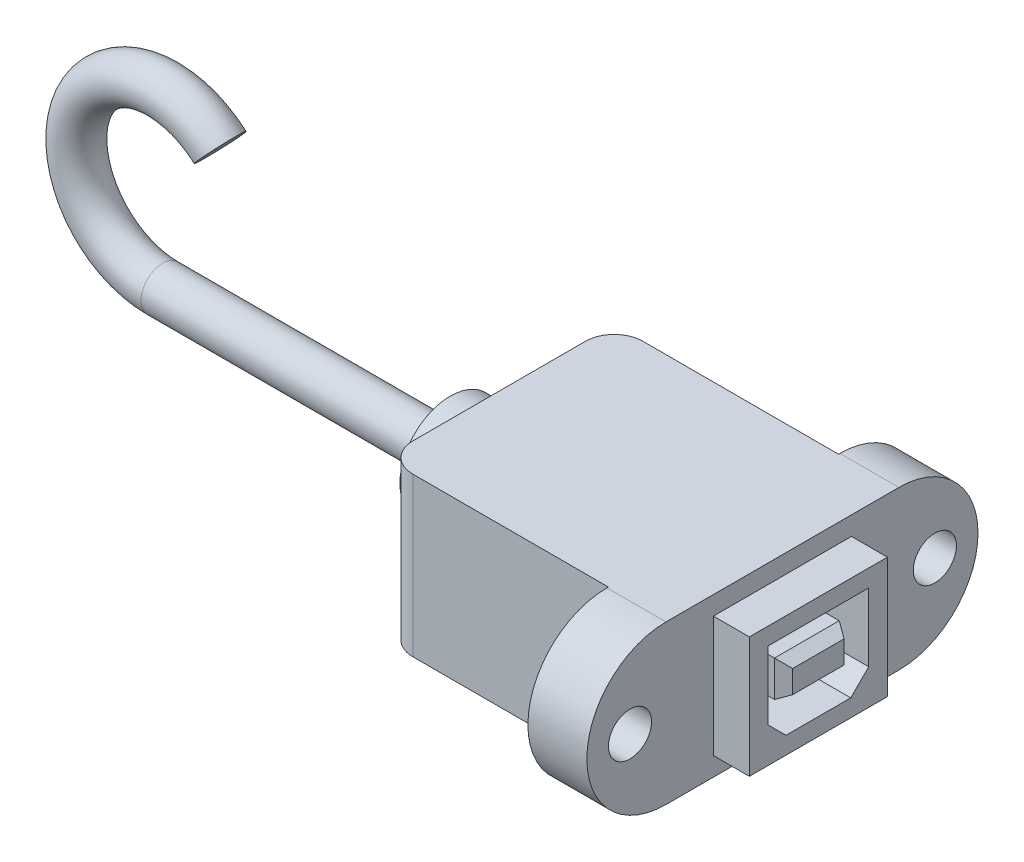
ISO-10303-21;
HEADER;
FILE_DESCRIPTION(('STEP AP214'),'2;1');
FILE_NAME('part.step','',(''),(''),'','','');
FILE_SCHEMA(('AUTOMOTIVE_DESIGN { 1 0 10303 214 1 1 1 1 }'));
ENDSEC;
DATA;
#1=APPLICATION_CONTEXT('core data for automotive mechanical design processes');
#2=APPLICATION_PROTOCOL_DEFINITION('international standard','automotive_design',2000,#1);
#3=PRODUCT_CONTEXT('',#1,'mechanical');
#4=PRODUCT('Part','Part','',(#3));
#5=PRODUCT_RELATED_PRODUCT_CATEGORY('part','',(#4));
#6=PRODUCT_DEFINITION_FORMATION('','',#4);
#7=PRODUCT_DEFINITION_CONTEXT('part definition',#1,'design');
#8=PRODUCT_DEFINITION('design','',#6,#7);
#9=PRODUCT_DEFINITION_SHAPE('','',#8);
#10=(LENGTH_UNIT() NAMED_UNIT(*) SI_UNIT(.MILLI.,.METRE.));
#11=(NAMED_UNIT(*) PLANE_ANGLE_UNIT() SI_UNIT($,.RADIAN.));
#12=(NAMED_UNIT(*) SI_UNIT($,.STERADIAN.) SOLID_ANGLE_UNIT());
#13=UNCERTAINTY_MEASURE_WITH_UNIT(LENGTH_MEASURE(1.E-05),#10,'distance_accuracy_value','');
#14=(GEOMETRIC_REPRESENTATION_CONTEXT(3) GLOBAL_UNCERTAINTY_ASSIGNED_CONTEXT((#13)) GLOBAL_UNIT_ASSIGNED_CONTEXT((#10,
#11,#12)) REPRESENTATION_CONTEXT('',''));
#15=CARTESIAN_POINT('',(0.,0.,0.));
#16=DIRECTION('',(0.,0.,1.));
#17=DIRECTION('',(1.,0.,0.));
#18=AXIS2_PLACEMENT_3D('',#15,#16,#17);
#19=CARTESIAN_POINT('',(25.019,13.97,-27.432));
#20=DIRECTION('',(-1.,0.,0.));
#21=DIRECTION('',(0.,0.,1.));
#22=AXIS2_PLACEMENT_3D('',#19,#20,#21);
#23=PLANE('',#22);
#24=CARTESIAN_POINT('',(25.019,6.985,-23.622));
#25=DIRECTION('',(1.,0.,0.));
#26=DIRECTION('',(0.,0.,-1.));
#27=AXIS2_PLACEMENT_3D('',#24,#25,#26);
#28=CIRCLE('',#27,1.905);
#29=CARTESIAN_POINT('',(25.019,6.985,-25.527));
#30=VERTEX_POINT('',#29);
#31=EDGE_CURVE('E315',#30,#30,#28,.T.);
#32=ORIENTED_EDGE('',*,*,#31,.F.);
#33=EDGE_LOOP('',(#32));
#34=FACE_BOUND('',#33,.T.);
#35=DIRECTION('',(0.,-1.,0.));
#36=VECTOR('',#35,1.);
#37=CARTESIAN_POINT('',(25.019,12.319,-4.064));
#38=LINE('',#37,#36);
#39=CARTESIAN_POINT('',(25.019,12.319,-4.064));
#40=VERTEX_POINT('',#39);
#41=CARTESIAN_POINT('',(25.019,1.651,-4.06400000000001));
#42=VERTEX_POINT('',#41);
#43=EDGE_CURVE('E388',#40,#42,#38,.T.);
#44=ORIENTED_EDGE('',*,*,#43,.F.);
#45=DIRECTION('',(0.,0.,1.));
#46=VECTOR('',#45,1.);
#47=CARTESIAN_POINT('',(25.019,12.319,-4.064));
#48=LINE('',#47,#46);
#49=CARTESIAN_POINT('',(25.019,12.319,-16.256));
#50=VERTEX_POINT('',#49);
#51=EDGE_CURVE('E403',#50,#40,#48,.T.);
#52=ORIENTED_EDGE('',*,*,#51,.F.);
#53=DIRECTION('',(0.,1.,0.));
#54=VECTOR('',#53,1.);
#55=CARTESIAN_POINT('',(25.019,12.319,-16.256));
#56=LINE('',#55,#54);
#57=CARTESIAN_POINT('',(25.019,1.651,-16.256));
#58=VERTEX_POINT('',#57);
#59=EDGE_CURVE('E415',#58,#50,#56,.T.);
#60=ORIENTED_EDGE('',*,*,#59,.F.);
#61=DIRECTION('',(0.,0.,-1.));
#62=VECTOR('',#61,1.);
#63=CARTESIAN_POINT('',(25.019,1.651,-4.06400000000001));
#64=LINE('',#63,#62);
#65=EDGE_CURVE('E412',#42,#58,#64,.T.);
#66=ORIENTED_EDGE('',*,*,#65,.F.);
#67=EDGE_LOOP('',(#44,#52,#60,#66));
#68=FACE_BOUND('',#67,.T.);
#69=CARTESIAN_POINT('',(25.019,6.985,0.126999999999997));
#70=DIRECTION('',(1.,0.,0.));
#71=DIRECTION('',(0.,0.,-1.));
#72=AXIS2_PLACEMENT_3D('',#69,#70,#71);
#73=CIRCLE('',#72,6.985);
#74=CARTESIAN_POINT('',(25.019,13.97,0.126999999999995));
#75=VERTEX_POINT('',#74);
#76=CARTESIAN_POINT('',(25.019,0.,0.126999999999997));
#77=VERTEX_POINT('',#76);
#78=EDGE_CURVE('E311',#75,#77,#73,.T.);
#79=ORIENTED_EDGE('',*,*,#78,.T.);
#80=DIRECTION('',(0.,0.,-1.));
#81=VECTOR('',#80,1.);
#82=CARTESIAN_POINT('',(25.019,0.,-27.432));
#83=LINE('',#82,#81);
#84=CARTESIAN_POINT('',(25.019,0.,-20.447));
#85=VERTEX_POINT('',#84);
#86=EDGE_CURVE('E452',#77,#85,#83,.T.);
#87=ORIENTED_EDGE('',*,*,#86,.T.);
#88=CARTESIAN_POINT('',(25.019,6.985,-20.447));
#89=DIRECTION('',(1.,0.,0.));
#90=DIRECTION('',(0.,0.,-1.));
#91=AXIS2_PLACEMENT_3D('',#88,#89,#90);
#92=CIRCLE('',#91,6.985);
#93=CARTESIAN_POINT('',(25.019,13.97,-20.447));
#94=VERTEX_POINT('',#93);
#95=EDGE_CURVE('E314',#94,#85,#92,.F.);
#96=ORIENTED_EDGE('',*,*,#95,.F.);
#97=DIRECTION('',(0.,0.,-1.));
#98=VECTOR('',#97,1.);
#99=CARTESIAN_POINT('',(25.019,13.97,-27.432));
#100=LINE('',#99,#98);
#101=EDGE_CURVE('E438',#75,#94,#100,.T.);
#102=ORIENTED_EDGE('',*,*,#101,.F.);
#103=EDGE_LOOP('',(#79,#87,#96,#102));
#104=FACE_BOUND('',#103,.T.);
#105=CARTESIAN_POINT('',(25.019,6.985,3.302));
#106=DIRECTION('',(1.,0.,0.));
#107=DIRECTION('',(0.,0.,-1.));
#108=AXIS2_PLACEMENT_3D('',#105,#106,#107);
#109=CIRCLE('',#108,1.905);
#110=CARTESIAN_POINT('',(25.019,6.985,1.397));
#111=VERTEX_POINT('',#110);
#112=EDGE_CURVE('E303',#111,#111,#109,.T.);
#113=ORIENTED_EDGE('',*,*,#112,.F.);
#114=EDGE_LOOP('',(#113));
#115=FACE_BOUND('',#114,.T.);
#116=ADVANCED_FACE('F116',(#34,#68,#104,#115),#23,.F.);
#117=CARTESIAN_POINT('',(19.812,13.97,7.112));
#118=DIRECTION('',(1.,0.,0.));
#119=DIRECTION('',(0.,0.,-1.));
#120=AXIS2_PLACEMENT_3D('',#117,#118,#119);
#121=PLANE('',#120);
#122=CARTESIAN_POINT('',(19.812,6.985,3.302));
#123=DIRECTION('',(1.,0.,0.));
#124=DIRECTION('',(0.,0.,-1.));
#125=AXIS2_PLACEMENT_3D('',#122,#123,#124);
#126=CIRCLE('',#125,1.905);
#127=CARTESIAN_POINT('',(19.812,6.985,1.397));
#128=VERTEX_POINT('',#127);
#129=EDGE_CURVE('E310',#128,#128,#126,.T.);
#130=ORIENTED_EDGE('',*,*,#129,.T.);
#131=EDGE_LOOP('',(#130));
#132=FACE_BOUND('',#131,.T.);
#133=DIRECTION('',(0.,0.,1.));
#134=VECTOR('',#133,1.);
#135=CARTESIAN_POINT('',(19.812,0.,7.112));
#136=LINE('',#135,#134);
#137=CARTESIAN_POINT('',(19.812,0.,0.));
#138=VERTEX_POINT('',#137);
#139=CARTESIAN_POINT('',(19.812,0.,0.126999999999997));
#140=VERTEX_POINT('',#139);
#141=EDGE_CURVE('E449',#138,#140,#136,.T.);
#142=ORIENTED_EDGE('',*,*,#141,.T.);
#143=CARTESIAN_POINT('',(19.812,6.985,0.126999999999997));
#144=DIRECTION('',(1.,0.,0.));
#145=DIRECTION('',(0.,0.,-1.));
#146=AXIS2_PLACEMENT_3D('',#143,#144,#145);
#147=CIRCLE('',#146,6.985);
#148=CARTESIAN_POINT('',(19.812,13.97,0.126999999999997));
#149=VERTEX_POINT('',#148);
#150=EDGE_CURVE('E322',#149,#140,#147,.T.);
#151=ORIENTED_EDGE('',*,*,#150,.F.);
#152=DIRECTION('',(0.,0.,1.));
#153=VECTOR('',#152,1.);
#154=CARTESIAN_POINT('',(19.812,13.97,7.112));
#155=LINE('',#154,#153);
#156=CARTESIAN_POINT('',(19.812,13.97,0.));
#157=VERTEX_POINT('',#156);
#158=EDGE_CURVE('E434',#157,#149,#155,.T.);
#159=ORIENTED_EDGE('',*,*,#158,.F.);
#160=DIRECTION('',(0.,-1.,0.));
#161=VECTOR('',#160,1.);
#162=CARTESIAN_POINT('',(19.812,13.97,0.));
#163=LINE('',#162,#161);
#164=EDGE_CURVE('E461',#157,#138,#163,.T.);
#165=ORIENTED_EDGE('',*,*,#164,.T.);
#166=EDGE_LOOP('',(#142,#151,#159,#165));
#167=FACE_BOUND('',#166,.T.);
#168=ADVANCED_FACE('F546',(#132,#167),#121,.F.);
#169=CARTESIAN_POINT('',(19.812,13.97,-20.32));
#170=DIRECTION('',(1.,0.,0.));
#171=DIRECTION('',(0.,0.,-1.));
#172=AXIS2_PLACEMENT_3D('',#169,#170,#171);
#173=PLANE('',#172);
#174=CARTESIAN_POINT('',(19.812,6.985,-23.622));
#175=DIRECTION('',(1.,0.,0.));
#176=DIRECTION('',(0.,0.,-1.));
#177=AXIS2_PLACEMENT_3D('',#174,#175,#176);
#178=CIRCLE('',#177,1.905);
#179=CARTESIAN_POINT('',(19.812,6.985,-25.527));
#180=VERTEX_POINT('',#179);
#181=EDGE_CURVE('E324',#180,#180,#178,.T.);
#182=ORIENTED_EDGE('',*,*,#181,.T.);
#183=EDGE_LOOP('',(#182));
#184=FACE_BOUND('',#183,.T.);
#185=DIRECTION('',(0.,0.,1.));
#186=VECTOR('',#185,1.);
#187=CARTESIAN_POINT('',(19.812,13.97,-20.32));
#188=LINE('',#187,#186);
#189=CARTESIAN_POINT('',(19.812,13.97,-20.447));
#190=VERTEX_POINT('',#189);
#191=CARTESIAN_POINT('',(19.812,13.97,-20.32));
#192=VERTEX_POINT('',#191);
#193=EDGE_CURVE('E441',#190,#192,#188,.T.);
#194=ORIENTED_EDGE('',*,*,#193,.F.);
#195=CARTESIAN_POINT('',(19.812,6.985,-20.447));
#196=DIRECTION('',(1.,0.,0.));
#197=DIRECTION('',(0.,0.,-1.));
#198=AXIS2_PLACEMENT_3D('',#195,#196,#197);
#199=CIRCLE('',#198,6.985);
#200=CARTESIAN_POINT('',(19.812,0.,-20.447));
#201=VERTEX_POINT('',#200);
#202=EDGE_CURVE('E313',#190,#201,#199,.F.);
#203=ORIENTED_EDGE('',*,*,#202,.T.);
#204=DIRECTION('',(0.,0.,1.));
#205=VECTOR('',#204,1.);
#206=CARTESIAN_POINT('',(19.812,0.,-20.32));
#207=LINE('',#206,#205);
#208=CARTESIAN_POINT('',(19.812,0.,-20.32));
#209=VERTEX_POINT('',#208);
#210=EDGE_CURVE('E454',#201,#209,#207,.T.);
#211=ORIENTED_EDGE('',*,*,#210,.T.);
#212=DIRECTION('',(0.,-1.,0.));
#213=VECTOR('',#212,1.);
#214=CARTESIAN_POINT('',(19.812,13.97,-20.32));
#215=LINE('',#214,#213);
#216=EDGE_CURVE('E447',#192,#209,#215,.T.);
#217=ORIENTED_EDGE('',*,*,#216,.F.);
#218=EDGE_LOOP('',(#194,#203,#211,#217));
#219=FACE_BOUND('',#218,.T.);
#220=ADVANCED_FACE('F560',(#184,#219),#173,.F.);
#221=CARTESIAN_POINT('',(19.812,13.97,0.));
#222=DIRECTION('',(0.,0.,-1.));
#223=DIRECTION('',(-1.,0.,0.));
#224=AXIS2_PLACEMENT_3D('',#221,#222,#223);
#225=PLANE('',#224);
#226=DIRECTION('',(1.,0.,0.));
#227=VECTOR('',#226,1.);
#228=CARTESIAN_POINT('',(19.812,13.97,0.));
#229=LINE('',#228,#227);
#230=CARTESIAN_POINT('',(2.54,13.97,0.));
#231=VERTEX_POINT('',#230);
#232=EDGE_CURVE('E432',#231,#157,#229,.T.);
#233=ORIENTED_EDGE('',*,*,#232,.F.);
#234=DIRECTION('',(0.,-1.,0.));
#235=VECTOR('',#234,1.);
#236=CARTESIAN_POINT('',(2.54,13.97,0.));
#237=LINE('',#236,#235);
#238=CARTESIAN_POINT('',(2.54,0.,0.));
#239=VERTEX_POINT('',#238);
#240=EDGE_CURVE('E504',#231,#239,#237,.T.);
#241=ORIENTED_EDGE('',*,*,#240,.T.);
#242=DIRECTION('',(1.,0.,0.));
#243=VECTOR('',#242,1.);
#244=CARTESIAN_POINT('',(19.812,0.,0.));
#245=LINE('',#244,#243);
#246=EDGE_CURVE('E431',#239,#138,#245,.T.);
#247=ORIENTED_EDGE('',*,*,#246,.T.);
#248=ORIENTED_EDGE('',*,*,#164,.F.);
#249=EDGE_LOOP('',(#233,#241,#247,#248));
#250=FACE_BOUND('',#249,.T.);
#251=ADVANCED_FACE('F542',(#250),#225,.F.);
#252=CARTESIAN_POINT('',(0.,13.97,-20.32));
#253=DIRECTION('',(0.,0.,1.));
#254=DIRECTION('',(1.,0.,0.));
#255=AXIS2_PLACEMENT_3D('',#252,#253,#254);
#256=PLANE('',#255);
#257=DIRECTION('',(-1.,0.,0.));
#258=VECTOR('',#257,1.);
#259=CARTESIAN_POINT('',(0.,0.,-20.32));
#260=LINE('',#259,#258);
#261=CARTESIAN_POINT('',(2.54,0.,-20.32));
#262=VERTEX_POINT('',#261);
#263=EDGE_CURVE('E456',#209,#262,#260,.T.);
#264=ORIENTED_EDGE('',*,*,#263,.T.);
#265=DIRECTION('',(0.,-1.,0.));
#266=VECTOR('',#265,1.);
#267=CARTESIAN_POINT('',(2.54,13.97,-20.32));
#268=LINE('',#267,#266);
#269=CARTESIAN_POINT('',(2.54,13.97,-20.32));
#270=VERTEX_POINT('',#269);
#271=EDGE_CURVE('E132',#262,#270,#268,.F.);
#272=ORIENTED_EDGE('',*,*,#271,.T.);
#273=DIRECTION('',(-1.,0.,0.));
#274=VECTOR('',#273,1.);
#275=CARTESIAN_POINT('',(0.,13.97,-20.32));
#276=LINE('',#275,#274);
#277=EDGE_CURVE('E443',#192,#270,#276,.T.);
#278=ORIENTED_EDGE('',*,*,#277,.F.);
#279=ORIENTED_EDGE('',*,*,#216,.T.);
#280=EDGE_LOOP('',(#264,#272,#278,#279));
#281=FACE_BOUND('',#280,.T.);
#282=ADVANCED_FACE('F528',(#281),#256,.F.);
#283=CARTESIAN_POINT('',(0.,13.97,0.));
#284=DIRECTION('',(1.,0.,0.));
#285=DIRECTION('',(0.,0.,-1.));
#286=AXIS2_PLACEMENT_3D('',#283,#284,#285);
#287=PLANE('',#286);
#288=CARTESIAN_POINT('',(0.,6.985,-10.16));
#289=DIRECTION('',(1.,0.,0.));
#290=DIRECTION('',(0.,0.,-1.));
#291=AXIS2_PLACEMENT_3D('',#288,#289,#290);
#292=CIRCLE('',#291,4.445);
#293=CARTESIAN_POINT('',(0.,6.985,-14.605));
#294=VERTEX_POINT('',#293);
#295=EDGE_CURVE('E120',#294,#294,#292,.F.);
#296=ORIENTED_EDGE('',*,*,#295,.F.);
#297=EDGE_LOOP('',(#296));
#298=FACE_BOUND('',#297,.T.);
#299=DIRECTION('',(0.,0.,1.));
#300=VECTOR('',#299,1.);
#301=CARTESIAN_POINT('',(0.,0.,0.));
#302=LINE('',#301,#300);
#303=CARTESIAN_POINT('',(0.,0.,-17.78));
#304=VERTEX_POINT('',#303);
#305=CARTESIAN_POINT('',(0.,0.,-2.54));
#306=VERTEX_POINT('',#305);
#307=EDGE_CURVE('E435',#304,#306,#302,.T.);
#308=ORIENTED_EDGE('',*,*,#307,.T.);
#309=DIRECTION('',(0.,-1.,0.));
#310=VECTOR('',#309,1.);
#311=CARTESIAN_POINT('',(0.,13.97,-2.54));
#312=LINE('',#311,#310);
#313=CARTESIAN_POINT('',(0.,13.97,-2.54));
#314=VERTEX_POINT('',#313);
#315=EDGE_CURVE('E140',#306,#314,#312,.F.);
#316=ORIENTED_EDGE('',*,*,#315,.T.);
#317=DIRECTION('',(0.,0.,1.));
#318=VECTOR('',#317,1.);
#319=CARTESIAN_POINT('',(0.,13.97,0.));
#320=LINE('',#319,#318);
#321=CARTESIAN_POINT('',(0.,13.97,-17.78));
#322=VERTEX_POINT('',#321);
#323=EDGE_CURVE('E445',#322,#314,#320,.T.);
#324=ORIENTED_EDGE('',*,*,#323,.F.);
#325=DIRECTION('',(0.,-1.,0.));
#326=VECTOR('',#325,1.);
#327=CARTESIAN_POINT('',(0.,13.97,-17.78));
#328=LINE('',#327,#326);
#329=EDGE_CURVE('E513',#322,#304,#328,.T.);
#330=ORIENTED_EDGE('',*,*,#329,.T.);
#331=EDGE_LOOP('',(#308,#316,#324,#330));
#332=FACE_BOUND('',#331,.T.);
#333=ADVANCED_FACE('F525',(#298,#332),#287,.F.);
#334=CARTESIAN_POINT('',(0.,13.97,0.));
#335=DIRECTION('',(0.,-1.,0.));
#336=DIRECTION('',(0.,0.,-1.));
#337=AXIS2_PLACEMENT_3D('',#334,#335,#336);
#338=PLANE('',#337);
#339=ORIENTED_EDGE('',*,*,#323,.T.);
#340=CARTESIAN_POINT('',(2.54,13.97,-2.54));
#341=DIRECTION('',(0.,-1.,0.));
#342=DIRECTION('',(0.,0.,-1.));
#343=AXIS2_PLACEMENT_3D('',#340,#341,#342);
#344=CIRCLE('',#343,2.54);
#345=EDGE_CURVE('E519',#314,#231,#344,.F.);
#346=ORIENTED_EDGE('',*,*,#345,.T.);
#347=ORIENTED_EDGE('',*,*,#232,.T.);
#348=ORIENTED_EDGE('',*,*,#158,.T.);
#349=DIRECTION('',(1.,0.,0.));
#350=VECTOR('',#349,1.);
#351=CARTESIAN_POINT('',(0.,13.97,0.126999999999997));
#352=LINE('',#351,#350);
#353=EDGE_CURVE('E493',#149,#75,#352,.T.);
#354=ORIENTED_EDGE('',*,*,#353,.T.);
#355=ORIENTED_EDGE('',*,*,#101,.T.);
#356=DIRECTION('',(1.,0.,0.));
#357=VECTOR('',#356,1.);
#358=CARTESIAN_POINT('',(0.,13.97,-20.447));
#359=LINE('',#358,#357);
#360=EDGE_CURVE('E501',#94,#190,#359,.F.);
#361=ORIENTED_EDGE('',*,*,#360,.T.);
#362=ORIENTED_EDGE('',*,*,#193,.T.);
#363=ORIENTED_EDGE('',*,*,#277,.T.);
#364=CARTESIAN_POINT('',(2.54,13.97,-17.78));
#365=DIRECTION('',(0.,-1.,0.));
#366=DIRECTION('',(0.,0.,-1.));
#367=AXIS2_PLACEMENT_3D('',#364,#365,#366);
#368=CIRCLE('',#367,2.54);
#369=EDGE_CURVE('E517',#270,#322,#368,.F.);
#370=ORIENTED_EDGE('',*,*,#369,.T.);
#371=EDGE_LOOP('',(#339,#346,#347,#348,#354,#355,#361,#362,#363,#370));
#372=FACE_BOUND('',#371,.T.);
#373=ADVANCED_FACE('F527',(#372),#338,.F.);
#374=CARTESIAN_POINT('',(0.,0.,0.));
#375=DIRECTION('',(0.,-1.,0.));
#376=DIRECTION('',(0.,0.,-1.));
#377=AXIS2_PLACEMENT_3D('',#374,#375,#376);
#378=PLANE('',#377);
#379=ORIENTED_EDGE('',*,*,#246,.F.);
#380=CARTESIAN_POINT('',(2.54,0.,-2.54));
#381=DIRECTION('',(0.,-1.,0.));
#382=DIRECTION('',(0.,0.,-1.));
#383=AXIS2_PLACEMENT_3D('',#380,#381,#382);
#384=CIRCLE('',#383,2.54);
#385=EDGE_CURVE('E511',#239,#306,#384,.T.);
#386=ORIENTED_EDGE('',*,*,#385,.T.);
#387=ORIENTED_EDGE('',*,*,#307,.F.);
#388=CARTESIAN_POINT('',(2.54,0.,-17.78));
#389=DIRECTION('',(0.,-1.,0.));
#390=DIRECTION('',(0.,0.,-1.));
#391=AXIS2_PLACEMENT_3D('',#388,#389,#390);
#392=CIRCLE('',#391,2.54);
#393=EDGE_CURVE('E509',#304,#262,#392,.T.);
#394=ORIENTED_EDGE('',*,*,#393,.T.);
#395=ORIENTED_EDGE('',*,*,#263,.F.);
#396=ORIENTED_EDGE('',*,*,#210,.F.);
#397=DIRECTION('',(1.,0.,0.));
#398=VECTOR('',#397,1.);
#399=CARTESIAN_POINT('',(0.,0.,-20.447));
#400=LINE('',#399,#398);
#401=EDGE_CURVE('E482',#85,#201,#400,.F.);
#402=ORIENTED_EDGE('',*,*,#401,.F.);
#403=ORIENTED_EDGE('',*,*,#86,.F.);
#404=DIRECTION('',(1.,0.,0.));
#405=VECTOR('',#404,1.);
#406=CARTESIAN_POINT('',(0.,0.,0.126999999999997));
#407=LINE('',#406,#405);
#408=EDGE_CURVE('E496',#140,#77,#407,.T.);
#409=ORIENTED_EDGE('',*,*,#408,.F.);
#410=ORIENTED_EDGE('',*,*,#141,.F.);
#411=EDGE_LOOP('',(#379,#386,#387,#394,#395,#396,#402,#403,#409,#410));
#412=FACE_BOUND('',#411,.T.);
#413=ADVANCED_FACE('F565',(#412),#378,.T.);
#414=CARTESIAN_POINT('',(28.194,12.319,-4.064));
#415=DIRECTION('',(0.,0.,-1.));
#416=DIRECTION('',(0.,1.,0.));
#417=AXIS2_PLACEMENT_3D('',#414,#415,#416);
#418=PLANE('',#417);
#419=ORIENTED_EDGE('',*,*,#43,.T.);
#420=DIRECTION('',(-1.,0.,0.));
#421=VECTOR('',#420,1.);
#422=CARTESIAN_POINT('',(28.194,1.651,-4.06400000000001));
#423=LINE('',#422,#421);
#424=CARTESIAN_POINT('',(28.194,1.651,-4.06400000000001));
#425=VERTEX_POINT('',#424);
#426=EDGE_CURVE('E428',#425,#42,#423,.T.);
#427=ORIENTED_EDGE('',*,*,#426,.F.);
#428=DIRECTION('',(0.,-1.,0.));
#429=VECTOR('',#428,1.);
#430=CARTESIAN_POINT('',(28.194,12.319,-4.064));
#431=LINE('',#430,#429);
#432=CARTESIAN_POINT('',(28.194,12.319,-4.064));
#433=VERTEX_POINT('',#432);
#434=EDGE_CURVE('E399',#433,#425,#431,.T.);
#435=ORIENTED_EDGE('',*,*,#434,.F.);
#436=DIRECTION('',(-1.,0.,0.));
#437=VECTOR('',#436,1.);
#438=CARTESIAN_POINT('',(28.194,12.319,-4.064));
#439=LINE('',#438,#437);
#440=EDGE_CURVE('E409',#433,#40,#439,.T.);
#441=ORIENTED_EDGE('',*,*,#440,.T.);
#442=EDGE_LOOP('',(#419,#427,#435,#441));
#443=FACE_BOUND('',#442,.T.);
#444=ADVANCED_FACE('F901',(#443),#418,.F.);
#445=CARTESIAN_POINT('',(28.194,1.651,-4.06400000000001));
#446=DIRECTION('',(0.,1.,0.));
#447=DIRECTION('',(0.,0.,1.));
#448=AXIS2_PLACEMENT_3D('',#445,#446,#447);
#449=PLANE('',#448);
#450=ORIENTED_EDGE('',*,*,#65,.T.);
#451=DIRECTION('',(-1.,0.,0.));
#452=VECTOR('',#451,1.);
#453=CARTESIAN_POINT('',(28.194,1.651,-16.256));
#454=LINE('',#453,#452);
#455=CARTESIAN_POINT('',(28.194,1.651,-16.256));
#456=VERTEX_POINT('',#455);
#457=EDGE_CURVE('E425',#456,#58,#454,.T.);
#458=ORIENTED_EDGE('',*,*,#457,.F.);
#459=DIRECTION('',(0.,0.,-1.));
#460=VECTOR('',#459,1.);
#461=CARTESIAN_POINT('',(28.194,1.651,-4.06400000000001));
#462=LINE('',#461,#460);
#463=EDGE_CURVE('E402',#425,#456,#462,.T.);
#464=ORIENTED_EDGE('',*,*,#463,.F.);
#465=ORIENTED_EDGE('',*,*,#426,.T.);
#466=EDGE_LOOP('',(#450,#458,#464,#465));
#467=FACE_BOUND('',#466,.T.);
#468=ADVANCED_FACE('F891',(#467),#449,.F.);
#469=CARTESIAN_POINT('',(28.194,12.319,-16.256));
#470=DIRECTION('',(0.,0.,1.));
#471=DIRECTION('',(1.,0.,0.));
#472=AXIS2_PLACEMENT_3D('',#469,#470,#471);
#473=PLANE('',#472);
#474=ORIENTED_EDGE('',*,*,#59,.T.);
#475=DIRECTION('',(-1.,0.,0.));
#476=VECTOR('',#475,1.);
#477=CARTESIAN_POINT('',(28.194,12.319,-16.256));
#478=LINE('',#477,#476);
#479=CARTESIAN_POINT('',(28.194,12.319,-16.256));
#480=VERTEX_POINT('',#479);
#481=EDGE_CURVE('E422',#480,#50,#478,.T.);
#482=ORIENTED_EDGE('',*,*,#481,.F.);
#483=DIRECTION('',(0.,1.,0.));
#484=VECTOR('',#483,1.);
#485=CARTESIAN_POINT('',(28.194,12.319,-16.256));
#486=LINE('',#485,#484);
#487=EDGE_CURVE('E405',#456,#480,#486,.T.);
#488=ORIENTED_EDGE('',*,*,#487,.F.);
#489=ORIENTED_EDGE('',*,*,#457,.T.);
#490=EDGE_LOOP('',(#474,#482,#488,#489));
#491=FACE_BOUND('',#490,.T.);
#492=ADVANCED_FACE('F881',(#491),#473,.F.);
#493=CARTESIAN_POINT('',(28.194,12.319,-4.064));
#494=DIRECTION('',(0.,-1.,0.));
#495=DIRECTION('',(0.,0.,-1.));
#496=AXIS2_PLACEMENT_3D('',#493,#494,#495);
#497=PLANE('',#496);
#498=ORIENTED_EDGE('',*,*,#51,.T.);
#499=ORIENTED_EDGE('',*,*,#440,.F.);
#500=DIRECTION('',(0.,0.,1.));
#501=VECTOR('',#500,1.);
#502=CARTESIAN_POINT('',(28.194,12.319,-4.064));
#503=LINE('',#502,#501);
#504=EDGE_CURVE('E407',#480,#433,#503,.T.);
#505=ORIENTED_EDGE('',*,*,#504,.F.);
#506=ORIENTED_EDGE('',*,*,#481,.T.);
#507=EDGE_LOOP('',(#498,#499,#505,#506));
#508=FACE_BOUND('',#507,.T.);
#509=ADVANCED_FACE('F872',(#508),#497,.F.);
#510=CARTESIAN_POINT('',(28.194,0.,0.));
#511=DIRECTION('',(1.,0.,0.));
#512=DIRECTION('',(0.,0.,-1.));
#513=AXIS2_PLACEMENT_3D('',#510,#511,#512);
#514=PLANE('',#513);
#515=DIRECTION('',(0.,-1.,0.));
#516=VECTOR('',#515,1.);
#517=CARTESIAN_POINT('',(28.194,4.76249999999999,-5.715));
#518=LINE('',#517,#516);
#519=CARTESIAN_POINT('',(28.194,10.795,-5.715));
#520=VERTEX_POINT('',#519);
#521=CARTESIAN_POINT('',(28.194,4.76249999999999,-5.715));
#522=VERTEX_POINT('',#521);
#523=EDGE_CURVE('E342',#520,#522,#518,.T.);
#524=ORIENTED_EDGE('',*,*,#523,.F.);
#525=DIRECTION('',(0.,0.,1.));
#526=VECTOR('',#525,1.);
#527=CARTESIAN_POINT('',(28.194,10.795,-5.715));
#528=LINE('',#527,#526);
#529=CARTESIAN_POINT('',(28.194,10.795,-14.605));
#530=VERTEX_POINT('',#529);
#531=EDGE_CURVE('E355',#530,#520,#528,.T.);
#532=ORIENTED_EDGE('',*,*,#531,.F.);
#533=DIRECTION('',(0.,1.,0.));
#534=VECTOR('',#533,1.);
#535=CARTESIAN_POINT('',(28.194,10.795,-14.605));
#536=LINE('',#535,#534);
#537=CARTESIAN_POINT('',(28.194,4.7625,-14.605));
#538=VERTEX_POINT('',#537);
#539=EDGE_CURVE('E381',#538,#530,#536,.T.);
#540=ORIENTED_EDGE('',*,*,#539,.F.);
#541=DIRECTION('',(0.,0.707106781186549,-0.707106781186546));
#542=VECTOR('',#541,1.);
#543=CARTESIAN_POINT('',(28.194,4.7625,-14.605));
#544=LINE('',#543,#542);
#545=CARTESIAN_POINT('',(28.194,3.175,-13.0175));
#546=VERTEX_POINT('',#545);
#547=EDGE_CURVE('E378',#546,#538,#544,.T.);
#548=ORIENTED_EDGE('',*,*,#547,.F.);
#549=DIRECTION('',(0.,0.,-1.));
#550=VECTOR('',#549,1.);
#551=CARTESIAN_POINT('',(28.194,3.175,-13.0175));
#552=LINE('',#551,#550);
#553=CARTESIAN_POINT('',(28.194,3.175,-7.3025));
#554=VERTEX_POINT('',#553);
#555=EDGE_CURVE('E375',#554,#546,#552,.T.);
#556=ORIENTED_EDGE('',*,*,#555,.F.);
#557=DIRECTION('',(0.,-0.707106781186546,-0.707106781186549));
#558=VECTOR('',#557,1.);
#559=CARTESIAN_POINT('',(28.194,3.175,-7.3025));
#560=LINE('',#559,#558);
#561=EDGE_CURVE('E372',#522,#554,#560,.T.);
#562=ORIENTED_EDGE('',*,*,#561,.F.);
#563=EDGE_LOOP('',(#524,#532,#540,#548,#556,#562));
#564=FACE_BOUND('',#563,.T.);
#565=ORIENTED_EDGE('',*,*,#434,.T.);
#566=ORIENTED_EDGE('',*,*,#463,.T.);
#567=ORIENTED_EDGE('',*,*,#487,.T.);
#568=ORIENTED_EDGE('',*,*,#504,.T.);
#569=EDGE_LOOP('',(#565,#566,#567,#568));
#570=FACE_BOUND('',#569,.T.);
#571=ADVANCED_FACE('F756',(#564,#570),#514,.T.);
#572=CARTESIAN_POINT('',(20.574,4.76249999999999,-5.715));
#573=DIRECTION('',(0.,0.,1.));
#574=DIRECTION('',(1.,0.,0.));
#575=AXIS2_PLACEMENT_3D('',#572,#573,#574);
#576=PLANE('',#575);
#577=ORIENTED_EDGE('',*,*,#523,.T.);
#578=DIRECTION('',(1.,0.,0.));
#579=VECTOR('',#578,1.);
#580=CARTESIAN_POINT('',(20.574,4.76249999999999,-5.715));
#581=LINE('',#580,#579);
#582=CARTESIAN_POINT('',(20.574,4.76249999999999,-5.715));
#583=VERTEX_POINT('',#582);
#584=EDGE_CURVE('E370',#583,#522,#581,.T.);
#585=ORIENTED_EDGE('',*,*,#584,.F.);
#586=DIRECTION('',(0.,-1.,0.));
#587=VECTOR('',#586,1.);
#588=CARTESIAN_POINT('',(20.574,4.76249999999999,-5.715));
#589=LINE('',#588,#587);
#590=CARTESIAN_POINT('',(20.574,10.795,-5.715));
#591=VERTEX_POINT('',#590);
#592=EDGE_CURVE('E351',#591,#583,#589,.T.);
#593=ORIENTED_EDGE('',*,*,#592,.F.);
#594=DIRECTION('',(1.,0.,0.));
#595=VECTOR('',#594,1.);
#596=CARTESIAN_POINT('',(20.574,10.795,-5.715));
#597=LINE('',#596,#595);
#598=EDGE_CURVE('E386',#591,#520,#597,.T.);
#599=ORIENTED_EDGE('',*,*,#598,.T.);
#600=EDGE_LOOP('',(#577,#585,#593,#599));
#601=FACE_BOUND('',#600,.T.);
#602=ADVANCED_FACE('F855',(#601),#576,.F.);
#603=CARTESIAN_POINT('',(20.574,10.795,-5.715));
#604=DIRECTION('',(0.,1.,0.));
#605=DIRECTION('',(0.,0.,1.));
#606=AXIS2_PLACEMENT_3D('',#603,#604,#605);
#607=PLANE('',#606);
#608=ORIENTED_EDGE('',*,*,#531,.T.);
#609=ORIENTED_EDGE('',*,*,#598,.F.);
#610=DIRECTION('',(0.,0.,1.));
#611=VECTOR('',#610,1.);
#612=CARTESIAN_POINT('',(20.574,10.795,-5.715));
#613=LINE('',#612,#611);
#614=CARTESIAN_POINT('',(20.574,10.795,-14.605));
#615=VERTEX_POINT('',#614);
#616=EDGE_CURVE('E367',#615,#591,#613,.T.);
#617=ORIENTED_EDGE('',*,*,#616,.F.);
#618=DIRECTION('',(1.,0.,0.));
#619=VECTOR('',#618,1.);
#620=CARTESIAN_POINT('',(20.574,10.795,-14.605));
#621=LINE('',#620,#619);
#622=EDGE_CURVE('E389',#615,#530,#621,.T.);
#623=ORIENTED_EDGE('',*,*,#622,.T.);
#624=EDGE_LOOP('',(#608,#609,#617,#623));
#625=FACE_BOUND('',#624,.T.);
#626=ADVANCED_FACE('F845',(#625),#607,.F.);
#627=CARTESIAN_POINT('',(20.574,10.795,-14.605));
#628=DIRECTION('',(0.,0.,-1.));
#629=DIRECTION('',(-1.,0.,0.));
#630=AXIS2_PLACEMENT_3D('',#627,#628,#629);
#631=PLANE('',#630);
#632=ORIENTED_EDGE('',*,*,#539,.T.);
#633=ORIENTED_EDGE('',*,*,#622,.F.);
#634=DIRECTION('',(0.,1.,0.));
#635=VECTOR('',#634,1.);
#636=CARTESIAN_POINT('',(20.574,10.795,-14.605));
#637=LINE('',#636,#635);
#638=CARTESIAN_POINT('',(20.574,4.7625,-14.605));
#639=VERTEX_POINT('',#638);
#640=EDGE_CURVE('E364',#639,#615,#637,.T.);
#641=ORIENTED_EDGE('',*,*,#640,.F.);
#642=DIRECTION('',(1.,0.,0.));
#643=VECTOR('',#642,1.);
#644=CARTESIAN_POINT('',(20.574,4.7625,-14.605));
#645=LINE('',#644,#643);
#646=EDGE_CURVE('E391',#639,#538,#645,.T.);
#647=ORIENTED_EDGE('',*,*,#646,.T.);
#648=EDGE_LOOP('',(#632,#633,#641,#647));
#649=FACE_BOUND('',#648,.T.);
#650=ADVANCED_FACE('F835',(#649),#631,.F.);
#651=CARTESIAN_POINT('',(20.574,4.7625,-14.605));
#652=DIRECTION('',(0.,-0.707106781186546,-0.707106781186549));
#653=DIRECTION('',(0.,0.707106781186549,-0.707106781186546));
#654=AXIS2_PLACEMENT_3D('',#651,#652,#653);
#655=PLANE('',#654);
#656=ORIENTED_EDGE('',*,*,#547,.T.);
#657=ORIENTED_EDGE('',*,*,#646,.F.);
#658=DIRECTION('',(0.,0.707106781186549,-0.707106781186546));
#659=VECTOR('',#658,1.);
#660=CARTESIAN_POINT('',(20.574,4.7625,-14.605));
#661=LINE('',#660,#659);
#662=CARTESIAN_POINT('',(20.574,3.175,-13.0175));
#663=VERTEX_POINT('',#662);
#664=EDGE_CURVE('E361',#663,#639,#661,.T.);
#665=ORIENTED_EDGE('',*,*,#664,.F.);
#666=DIRECTION('',(1.,0.,0.));
#667=VECTOR('',#666,1.);
#668=CARTESIAN_POINT('',(20.574,3.175,-13.0175));
#669=LINE('',#668,#667);
#670=EDGE_CURVE('E393',#663,#546,#669,.T.);
#671=ORIENTED_EDGE('',*,*,#670,.T.);
#672=EDGE_LOOP('',(#656,#657,#665,#671));
#673=FACE_BOUND('',#672,.T.);
#674=ADVANCED_FACE('F825',(#673),#655,.F.);
#675=CARTESIAN_POINT('',(20.574,3.175,-13.0175));
#676=DIRECTION('',(0.,-1.,0.));
#677=DIRECTION('',(0.,0.,-1.));
#678=AXIS2_PLACEMENT_3D('',#675,#676,#677);
#679=PLANE('',#678);
#680=ORIENTED_EDGE('',*,*,#555,.T.);
#681=ORIENTED_EDGE('',*,*,#670,.F.);
#682=DIRECTION('',(0.,0.,-1.));
#683=VECTOR('',#682,1.);
#684=CARTESIAN_POINT('',(20.574,3.175,-13.0175));
#685=LINE('',#684,#683);
#686=CARTESIAN_POINT('',(20.574,3.175,-7.3025));
#687=VERTEX_POINT('',#686);
#688=EDGE_CURVE('E358',#687,#663,#685,.T.);
#689=ORIENTED_EDGE('',*,*,#688,.F.);
#690=DIRECTION('',(1.,0.,0.));
#691=VECTOR('',#690,1.);
#692=CARTESIAN_POINT('',(20.574,3.175,-7.3025));
#693=LINE('',#692,#691);
#694=EDGE_CURVE('E395',#687,#554,#693,.T.);
#695=ORIENTED_EDGE('',*,*,#694,.T.);
#696=EDGE_LOOP('',(#680,#681,#689,#695));
#697=FACE_BOUND('',#696,.T.);
#698=ADVANCED_FACE('F815',(#697),#679,.F.);
#699=CARTESIAN_POINT('',(20.574,3.175,-7.3025));
#700=DIRECTION('',(0.,-0.707106781186549,0.707106781186546));
#701=DIRECTION('',(0.,-0.707106781186546,-0.707106781186549));
#702=AXIS2_PLACEMENT_3D('',#699,#700,#701);
#703=PLANE('',#702);
#704=ORIENTED_EDGE('',*,*,#561,.T.);
#705=ORIENTED_EDGE('',*,*,#694,.F.);
#706=DIRECTION('',(0.,-0.707106781186546,-0.707106781186549));
#707=VECTOR('',#706,1.);
#708=CARTESIAN_POINT('',(20.574,3.175,-7.3025));
#709=LINE('',#708,#707);
#710=EDGE_CURVE('E354',#583,#687,#709,.T.);
#711=ORIENTED_EDGE('',*,*,#710,.F.);
#712=ORIENTED_EDGE('',*,*,#584,.T.);
#713=EDGE_LOOP('',(#704,#705,#711,#712));
#714=FACE_BOUND('',#713,.T.);
#715=ADVANCED_FACE('F805',(#714),#703,.F.);
#716=CARTESIAN_POINT('',(20.574,0.,0.));
#717=DIRECTION('',(-1.,0.,0.));
#718=DIRECTION('',(0.,0.,1.));
#719=AXIS2_PLACEMENT_3D('',#716,#717,#718);
#720=PLANE('',#719);
#721=DIRECTION('',(0.,-1.,0.));
#722=VECTOR('',#721,1.);
#723=CARTESIAN_POINT('',(20.574,8.5725,-7.3025));
#724=LINE('',#723,#722);
#725=CARTESIAN_POINT('',(20.574,8.5725,-7.3025));
#726=VERTEX_POINT('',#725);
#727=CARTESIAN_POINT('',(20.574,5.3975,-7.3025));
#728=VERTEX_POINT('',#727);
#729=EDGE_CURVE('E325',#726,#728,#724,.T.);
#730=ORIENTED_EDGE('',*,*,#729,.F.);
#731=DIRECTION('',(0.,0.,1.));
#732=VECTOR('',#731,1.);
#733=CARTESIAN_POINT('',(20.574,8.5725,-7.3025));
#734=LINE('',#733,#732);
#735=CARTESIAN_POINT('',(20.574,8.5725,-13.0175));
#736=VERTEX_POINT('',#735);
#737=EDGE_CURVE('E335',#736,#726,#734,.T.);
#738=ORIENTED_EDGE('',*,*,#737,.F.);
#739=DIRECTION('',(0.,1.,0.));
#740=VECTOR('',#739,1.);
#741=CARTESIAN_POINT('',(20.574,8.5725,-13.0175));
#742=LINE('',#741,#740);
#743=CARTESIAN_POINT('',(20.574,5.3975,-13.0175));
#744=VERTEX_POINT('',#743);
#745=EDGE_CURVE('E332',#744,#736,#742,.T.);
#746=ORIENTED_EDGE('',*,*,#745,.F.);
#747=DIRECTION('',(0.,0.,-1.));
#748=VECTOR('',#747,1.);
#749=CARTESIAN_POINT('',(20.574,5.3975,-7.3025));
#750=LINE('',#749,#748);
#751=EDGE_CURVE('E328',#728,#744,#750,.T.);
#752=ORIENTED_EDGE('',*,*,#751,.F.);
#753=EDGE_LOOP('',(#730,#738,#746,#752));
#754=FACE_BOUND('',#753,.T.);
#755=ORIENTED_EDGE('',*,*,#592,.T.);
#756=ORIENTED_EDGE('',*,*,#710,.T.);
#757=ORIENTED_EDGE('',*,*,#688,.T.);
#758=ORIENTED_EDGE('',*,*,#664,.T.);
#759=ORIENTED_EDGE('',*,*,#640,.T.);
#760=ORIENTED_EDGE('',*,*,#616,.T.);
#761=EDGE_LOOP('',(#755,#756,#757,#758,#759,#760));
#762=FACE_BOUND('',#761,.T.);
#763=ADVANCED_FACE('F795',(#754,#762),#720,.F.);
#764=CARTESIAN_POINT('',(20.574,8.5725,-7.3025));
#765=DIRECTION('',(0.,0.,1.));
#766=DIRECTION('',(1.,0.,0.));
#767=AXIS2_PLACEMENT_3D('',#764,#765,#766);
#768=PLANE('',#767);
#769=DIRECTION('',(1.,0.,0.));
#770=VECTOR('',#769,1.);
#771=CARTESIAN_POINT('',(20.574,5.3975,-7.3025));
#772=LINE('',#771,#770);
#773=CARTESIAN_POINT('',(27.178,5.3975,-7.3025));
#774=VERTEX_POINT('',#773);
#775=EDGE_CURVE('E338',#728,#774,#772,.T.);
#776=ORIENTED_EDGE('',*,*,#775,.T.);
#777=DIRECTION('',(0.,1.,0.));
#778=VECTOR('',#777,1.);
#779=CARTESIAN_POINT('',(27.178,8.5725,-7.3025));
#780=LINE('',#779,#778);
#781=CARTESIAN_POINT('',(27.178,8.5725,-7.3025));
#782=VERTEX_POINT('',#781);
#783=EDGE_CURVE('E478',#774,#782,#780,.T.);
#784=ORIENTED_EDGE('',*,*,#783,.T.);
#785=DIRECTION('',(1.,0.,0.));
#786=VECTOR('',#785,1.);
#787=CARTESIAN_POINT('',(20.574,8.5725,-7.3025));
#788=LINE('',#787,#786);
#789=EDGE_CURVE('E339',#726,#782,#788,.T.);
#790=ORIENTED_EDGE('',*,*,#789,.F.);
#791=ORIENTED_EDGE('',*,*,#729,.T.);
#792=EDGE_LOOP('',(#776,#784,#790,#791));
#793=FACE_BOUND('',#792,.T.);
#794=ADVANCED_FACE('F785',(#793),#768,.T.);
#795=CARTESIAN_POINT('',(20.574,8.5725,-7.3025));
#796=DIRECTION('',(0.,1.,0.));
#797=DIRECTION('',(0.,0.,1.));
#798=AXIS2_PLACEMENT_3D('',#795,#796,#797);
#799=PLANE('',#798);
#800=ORIENTED_EDGE('',*,*,#789,.T.);
#801=DIRECTION('',(0.,0.,-1.));
#802=VECTOR('',#801,1.);
#803=CARTESIAN_POINT('',(27.178,8.5725,-7.3025));
#804=LINE('',#803,#802);
#805=CARTESIAN_POINT('',(27.178,8.5725,-13.0175));
#806=VERTEX_POINT('',#805);
#807=EDGE_CURVE('E480',#782,#806,#804,.T.);
#808=ORIENTED_EDGE('',*,*,#807,.T.);
#809=DIRECTION('',(1.,0.,0.));
#810=VECTOR('',#809,1.);
#811=CARTESIAN_POINT('',(20.574,8.5725,-13.0175));
#812=LINE('',#811,#810);
#813=EDGE_CURVE('E343',#736,#806,#812,.T.);
#814=ORIENTED_EDGE('',*,*,#813,.F.);
#815=ORIENTED_EDGE('',*,*,#737,.T.);
#816=EDGE_LOOP('',(#800,#808,#814,#815));
#817=FACE_BOUND('',#816,.T.);
#818=ADVANCED_FACE('F775',(#817),#799,.T.);
#819=CARTESIAN_POINT('',(20.574,8.5725,-13.0175));
#820=DIRECTION('',(0.,0.,-1.));
#821=DIRECTION('',(-1.,0.,0.));
#822=AXIS2_PLACEMENT_3D('',#819,#820,#821);
#823=PLANE('',#822);
#824=ORIENTED_EDGE('',*,*,#813,.T.);
#825=DIRECTION('',(0.,-1.,0.));
#826=VECTOR('',#825,1.);
#827=CARTESIAN_POINT('',(27.178,8.5725,-13.0175));
#828=LINE('',#827,#826);
#829=CARTESIAN_POINT('',(27.178,5.3975,-13.0175));
#830=VERTEX_POINT('',#829);
#831=EDGE_CURVE('E473',#806,#830,#828,.T.);
#832=ORIENTED_EDGE('',*,*,#831,.T.);
#833=DIRECTION('',(1.,0.,0.));
#834=VECTOR('',#833,1.);
#835=CARTESIAN_POINT('',(20.574,5.3975,-13.0175));
#836=LINE('',#835,#834);
#837=EDGE_CURVE('E346',#744,#830,#836,.T.);
#838=ORIENTED_EDGE('',*,*,#837,.F.);
#839=ORIENTED_EDGE('',*,*,#745,.T.);
#840=EDGE_LOOP('',(#824,#832,#838,#839));
#841=FACE_BOUND('',#840,.T.);
#842=ADVANCED_FACE('F765',(#841),#823,.T.);
#843=CARTESIAN_POINT('',(20.574,5.3975,-7.3025));
#844=DIRECTION('',(0.,-1.,0.));
#845=DIRECTION('',(0.,0.,-1.));
#846=AXIS2_PLACEMENT_3D('',#843,#844,#845);
#847=PLANE('',#846);
#848=ORIENTED_EDGE('',*,*,#837,.T.);
#849=DIRECTION('',(0.,0.,1.));
#850=VECTOR('',#849,1.);
#851=CARTESIAN_POINT('',(27.178,5.3975,-7.3025));
#852=LINE('',#851,#850);
#853=EDGE_CURVE('E476',#830,#774,#852,.T.);
#854=ORIENTED_EDGE('',*,*,#853,.T.);
#855=ORIENTED_EDGE('',*,*,#775,.F.);
#856=ORIENTED_EDGE('',*,*,#751,.T.);
#857=EDGE_LOOP('',(#848,#854,#855,#856));
#858=FACE_BOUND('',#857,.T.);
#859=ADVANCED_FACE('F753',(#858),#847,.T.);
#860=DIRECTION('',(0.,0.,-1.));
#861=VECTOR('',#860,1.);
#862=CARTESIAN_POINT('',(28.194,5.98408787349666,0.));
#863=LINE('',#862,#861);
#864=CARTESIAN_POINT('',(28.194,5.98408787349667,-7.88908787349667));
#865=VERTEX_POINT('',#864);
#866=CARTESIAN_POINT('',(28.194,5.98408787349667,-12.4309121265033));
#867=VERTEX_POINT('',#866);
#868=EDGE_CURVE('E468',#865,#867,#863,.T.);
#869=ORIENTED_EDGE('',*,*,#868,.T.);
#870=DIRECTION('',(0.,1.,0.));
#871=VECTOR('',#870,1.);
#872=CARTESIAN_POINT('',(28.194,0.,-12.4309121265033));
#873=LINE('',#872,#871);
#874=CARTESIAN_POINT('',(28.194,7.98591212650334,-12.4309121265033));
#875=VERTEX_POINT('',#874);
#876=EDGE_CURVE('E470',#867,#875,#873,.T.);
#877=ORIENTED_EDGE('',*,*,#876,.T.);
#878=DIRECTION('',(0.,0.,1.));
#879=VECTOR('',#878,1.);
#880=CARTESIAN_POINT('',(28.194,7.98591212650334,0.));
#881=LINE('',#880,#879);
#882=CARTESIAN_POINT('',(28.194,7.98591212650334,-7.88908787349667));
#883=VERTEX_POINT('',#882);
#884=EDGE_CURVE('E464',#875,#883,#881,.T.);
#885=ORIENTED_EDGE('',*,*,#884,.T.);
#886=DIRECTION('',(0.,-1.,0.));
#887=VECTOR('',#886,1.);
#888=CARTESIAN_POINT('',(28.194,0.,-7.88908787349667));
#889=LINE('',#888,#887);
#890=EDGE_CURVE('E466',#883,#865,#889,.T.);
#891=ORIENTED_EDGE('',*,*,#890,.T.);
#892=EDGE_LOOP('',(#869,#877,#885,#891));
#893=FACE_BOUND('',#892,.T.);
#894=ADVANCED_FACE('F609',(#893),#514,.T.);
#895=CARTESIAN_POINT('',(28.194,0.,-7.88908787349667));
#896=DIRECTION('',(-0.499999999999996,0.,-0.866025403784441));
#897=DIRECTION('',(0.,-1.,0.));
#898=AXIS2_PLACEMENT_3D('',#895,#896,#897);
#899=PLANE('',#898);
#900=DIRECTION('',(0.774596669241487,-0.447213595499955,-0.447213595499955));
#901=VECTOR('',#900,1.);
#902=CARTESIAN_POINT('',(25.4611397955457,9.56372970120265,-6.31127029879736));
#903=LINE('',#902,#901);
#904=EDGE_CURVE('E487',#782,#883,#903,.T.);
#905=ORIENTED_EDGE('',*,*,#904,.F.);
#906=ORIENTED_EDGE('',*,*,#783,.F.);
#907=DIRECTION('',(0.774596669241487,0.447213595499955,-0.447213595499955));
#908=VECTOR('',#907,1.);
#909=CARTESIAN_POINT('',(26.1210511532294,4.78727029879735,-6.69227029879735));
#910=LINE('',#909,#908);
#911=EDGE_CURVE('E329',#865,#774,#910,.F.);
#912=ORIENTED_EDGE('',*,*,#911,.F.);
#913=ORIENTED_EDGE('',*,*,#890,.F.);
#914=EDGE_LOOP('',(#905,#906,#912,#913));
#915=FACE_BOUND('',#914,.T.);
#916=ADVANCED_FACE('F606',(#915),#899,.F.);
#917=CARTESIAN_POINT('',(28.194,5.98408787349666,0.));
#918=DIRECTION('',(-0.499999999999996,0.866025403784441,0.));
#919=DIRECTION('',(0.,0.,-1.));
#920=AXIS2_PLACEMENT_3D('',#917,#918,#919);
#921=PLANE('',#920);
#922=ORIENTED_EDGE('',*,*,#911,.T.);
#923=ORIENTED_EDGE('',*,*,#853,.F.);
#924=DIRECTION('',(0.774596669241487,0.447213595499955,0.447213595499955));
#925=VECTOR('',#924,1.);
#926=CARTESIAN_POINT('',(32.5001942775056,8.4702702987973,-9.9447297012027));
#927=LINE('',#926,#925);
#928=EDGE_CURVE('E485',#867,#830,#927,.F.);
#929=ORIENTED_EDGE('',*,*,#928,.F.);
#930=ORIENTED_EDGE('',*,*,#868,.F.);
#931=EDGE_LOOP('',(#922,#923,#929,#930));
#932=FACE_BOUND('',#931,.T.);
#933=ADVANCED_FACE('F602',(#932),#921,.F.);
#934=CARTESIAN_POINT('',(28.194,7.98591212650334,0.));
#935=DIRECTION('',(-0.499999999999996,-0.866025403784441,0.));
#936=DIRECTION('',(0.,0.,1.));
#937=AXIS2_PLACEMENT_3D('',#934,#935,#936);
#938=PLANE('',#937);
#939=ORIENTED_EDGE('',*,*,#904,.T.);
#940=ORIENTED_EDGE('',*,*,#884,.F.);
#941=DIRECTION('',(-0.774596669241487,0.447213595499955,-0.447213595499955));
#942=VECTOR('',#941,1.);
#943=CARTESIAN_POINT('',(32.5001942775056,5.4997297012027,-9.94472970120271));
#944=LINE('',#943,#942);
#945=EDGE_CURVE('E483',#806,#875,#944,.F.);
#946=ORIENTED_EDGE('',*,*,#945,.F.);
#947=ORIENTED_EDGE('',*,*,#807,.F.);
#948=EDGE_LOOP('',(#939,#940,#946,#947));
#949=FACE_BOUND('',#948,.T.);
#950=ADVANCED_FACE('F598',(#949),#938,.F.);
#951=CARTESIAN_POINT('',(28.194,0.,-12.4309121265033));
#952=DIRECTION('',(-0.499999999999996,0.,0.866025403784441));
#953=DIRECTION('',(0.,1.,0.));
#954=AXIS2_PLACEMENT_3D('',#951,#952,#953);
#955=PLANE('',#954);
#956=ORIENTED_EDGE('',*,*,#928,.T.);
#957=ORIENTED_EDGE('',*,*,#831,.F.);
#958=ORIENTED_EDGE('',*,*,#945,.T.);
#959=ORIENTED_EDGE('',*,*,#876,.F.);
#960=EDGE_LOOP('',(#956,#957,#958,#959));
#961=FACE_BOUND('',#960,.T.);
#962=ADVANCED_FACE('F578',(#961),#955,.F.);
#963=CARTESIAN_POINT('',(0.,6.985,-20.447));
#964=DIRECTION('',(1.,0.,0.));
#965=DIRECTION('',(0.,0.,-1.));
#966=AXIS2_PLACEMENT_3D('',#963,#964,#965);
#967=CYLINDRICAL_SURFACE('',#966,6.985);
#968=ORIENTED_EDGE('',*,*,#202,.F.);
#969=ORIENTED_EDGE('',*,*,#360,.F.);
#970=ORIENTED_EDGE('',*,*,#95,.T.);
#971=ORIENTED_EDGE('',*,*,#401,.T.);
#972=EDGE_LOOP('',(#968,#969,#970,#971));
#973=FACE_BOUND('',#972,.T.);
#974=ADVANCED_FACE('F556',(#973),#967,.T.);
#975=CARTESIAN_POINT('',(0.,6.985,0.126999999999997));
#976=DIRECTION('',(1.,0.,0.));
#977=DIRECTION('',(0.,0.,-1.));
#978=AXIS2_PLACEMENT_3D('',#975,#976,#977);
#979=CYLINDRICAL_SURFACE('',#978,6.985);
#980=ORIENTED_EDGE('',*,*,#150,.T.);
#981=ORIENTED_EDGE('',*,*,#408,.T.);
#982=ORIENTED_EDGE('',*,*,#78,.F.);
#983=ORIENTED_EDGE('',*,*,#353,.F.);
#984=EDGE_LOOP('',(#980,#981,#982,#983));
#985=FACE_BOUND('',#984,.T.);
#986=ADVANCED_FACE('F567',(#985),#979,.T.);
#987=CARTESIAN_POINT('',(0.,6.985,-23.622));
#988=DIRECTION('',(1.,0.,0.));
#989=DIRECTION('',(0.,0.,-1.));
#990=AXIS2_PLACEMENT_3D('',#987,#988,#989);
#991=CYLINDRICAL_SURFACE('',#990,1.905);
#992=ORIENTED_EDGE('',*,*,#31,.T.);
#993=EDGE_LOOP('',(#992));
#994=FACE_BOUND('',#993,.T.);
#995=ORIENTED_EDGE('',*,*,#181,.F.);
#996=EDGE_LOOP('',(#995));
#997=FACE_BOUND('',#996,.T.);
#998=ADVANCED_FACE('F569',(#994,#997),#991,.F.);
#999=CARTESIAN_POINT('',(0.,6.985,3.302));
#1000=DIRECTION('',(1.,0.,0.));
#1001=DIRECTION('',(0.,0.,-1.));
#1002=AXIS2_PLACEMENT_3D('',#999,#1000,#1001);
#1003=CYLINDRICAL_SURFACE('',#1002,1.905);
#1004=ORIENTED_EDGE('',*,*,#112,.T.);
#1005=EDGE_LOOP('',(#1004));
#1006=FACE_BOUND('',#1005,.T.);
#1007=ORIENTED_EDGE('',*,*,#129,.F.);
#1008=EDGE_LOOP('',(#1007));
#1009=FACE_BOUND('',#1008,.T.);
#1010=ADVANCED_FACE('F575',(#1006,#1009),#1003,.F.);
#1011=CARTESIAN_POINT('',(2.54,13.97,-2.54));
#1012=DIRECTION('',(0.,-1.,0.));
#1013=DIRECTION('',(0.,0.,-1.));
#1014=AXIS2_PLACEMENT_3D('',#1011,#1012,#1013);
#1015=CYLINDRICAL_SURFACE('',#1014,2.54);
#1016=ORIENTED_EDGE('',*,*,#345,.F.);
#1017=ORIENTED_EDGE('',*,*,#315,.F.);
#1018=ORIENTED_EDGE('',*,*,#385,.F.);
#1019=ORIENTED_EDGE('',*,*,#240,.F.);
#1020=EDGE_LOOP('',(#1016,#1017,#1018,#1019));
#1021=FACE_BOUND('',#1020,.T.);
#1022=ADVANCED_FACE('F535',(#1021),#1015,.T.);
#1023=CARTESIAN_POINT('',(2.54,13.97,-17.78));
#1024=DIRECTION('',(0.,-1.,0.));
#1025=DIRECTION('',(0.,0.,-1.));
#1026=AXIS2_PLACEMENT_3D('',#1023,#1024,#1025);
#1027=CYLINDRICAL_SURFACE('',#1026,2.54);
#1028=ORIENTED_EDGE('',*,*,#369,.F.);
#1029=ORIENTED_EDGE('',*,*,#271,.F.);
#1030=ORIENTED_EDGE('',*,*,#393,.F.);
#1031=ORIENTED_EDGE('',*,*,#329,.F.);
#1032=EDGE_LOOP('',(#1028,#1029,#1030,#1031));
#1033=FACE_BOUND('',#1032,.T.);
#1034=ADVANCED_FACE('F118',(#1033),#1027,.T.);
#1035=CARTESIAN_POINT('',(-4.318,6.985,-10.16));
#1036=DIRECTION('',(1.,0.,0.));
#1037=DIRECTION('',(0.,0.,-1.));
#1038=AXIS2_PLACEMENT_3D('',#1035,#1036,#1037);
#1039=CYLINDRICAL_SURFACE('',#1038,4.445);
#1040=CARTESIAN_POINT('',(-4.318,6.985,-10.16));
#1041=DIRECTION('',(-1.,0.,0.));
#1042=DIRECTION('',(0.,0.,1.));
#1043=AXIS2_PLACEMENT_3D('',#1040,#1041,#1042);
#1044=CIRCLE('',#1043,4.445);
#1045=CARTESIAN_POINT('',(-4.318,6.985,-5.715));
#1046=VERTEX_POINT('',#1045);
#1047=EDGE_CURVE('E299',#1046,#1046,#1044,.T.);
#1048=ORIENTED_EDGE('',*,*,#1047,.F.);
#1049=EDGE_LOOP('',(#1048));
#1050=FACE_BOUND('',#1049,.T.);
#1051=ORIENTED_EDGE('',*,*,#295,.T.);
#1052=EDGE_LOOP('',(#1051));
#1053=FACE_BOUND('',#1052,.T.);
#1054=ADVANCED_FACE('F523',(#1050,#1053),#1039,.T.);
#1055=CARTESIAN_POINT('',(-4.318,6.985,-10.16));
#1056=DIRECTION('',(-1.,0.,0.));
#1057=DIRECTION('',(0.,0.,1.));
#1058=AXIS2_PLACEMENT_3D('',#1055,#1056,#1057);
#1059=PLANE('',#1058);
#1060=CARTESIAN_POINT('',(-4.318,6.985,-10.16));
#1061=DIRECTION('',(-1.,0.,0.));
#1062=DIRECTION('',(0.,0.,1.));
#1063=AXIS2_PLACEMENT_3D('',#1060,#1061,#1062);
#1064=CIRCLE('',#1063,1.905);
#1065=CARTESIAN_POINT('',(-4.318,6.985,-8.255));
#1066=VERTEX_POINT('',#1065);
#1067=EDGE_CURVE('E12',#1066,#1066,#1064,.T.);
#1068=ORIENTED_EDGE('',*,*,#1067,.F.);
#1069=EDGE_LOOP('',(#1068));
#1070=FACE_BOUND('',#1069,.T.);
#1071=ORIENTED_EDGE('',*,*,#1047,.T.);
#1072=EDGE_LOOP('',(#1071));
#1073=FACE_BOUND('',#1072,.T.);
#1074=ADVANCED_FACE('F623',(#1070,#1073),#1059,.T.);
#1075=CARTESIAN_POINT('',(-24.638,20.2846126628495,-10.16));
#1076=DIRECTION('',(0.74535599249993,-0.666666666666667,0.));
#1077=DIRECTION('',(0.,0.,1.));
#1078=AXIS2_PLACEMENT_3D('',#1075,#1076,#1077);
#1079=PLANE('',#1078);
#1080=CARTESIAN_POINT('',(-24.638,20.2846126628495,-10.16));
#1081=DIRECTION('',(0.74535599249993,-0.666666666666667,0.));
#1082=DIRECTION('',(0.,0.,1.));
#1083=AXIS2_PLACEMENT_3D('',#1080,#1081,#1082);
#1084=CIRCLE('',#1083,1.905);
#1085=CARTESIAN_POINT('',(-24.638,20.2846126628495,-8.255));
#1086=VERTEX_POINT('',#1085);
#1087=EDGE_CURVE('E296',#1086,#1086,#1084,.T.);
#1088=ORIENTED_EDGE('',*,*,#1087,.T.);
#1089=EDGE_LOOP('',(#1088));
#1090=FACE_BOUND('',#1089,.T.);
#1091=ADVANCED_FACE('F297',(#1090),#1079,.T.);
#1092=CARTESIAN_POINT('',(-4.318,6.985,-10.16));
#1093=DIRECTION('',(-1.,0.,0.));
#1094=DIRECTION('',(0.,0.,1.));
#1095=AXIS2_PLACEMENT_3D('',#1092,#1093,#1094);
#1096=CYLINDRICAL_SURFACE('',#1095,1.905);
#1097=CARTESIAN_POINT('',(-29.718,6.985,-10.16));
#1098=DIRECTION('',(-1.,0.,0.));
#1099=DIRECTION('',(0.,0.,1.));
#1100=AXIS2_PLACEMENT_3D('',#1097,#1098,#1099);
#1101=CIRCLE('',#1100,1.905);
#1102=CARTESIAN_POINT('',(-29.718,6.985,-8.255));
#1103=VERTEX_POINT('',#1102);
#1104=EDGE_CURVE('E300',#1103,#1103,#1101,.T.);
#1105=ORIENTED_EDGE('',*,*,#1104,.F.);
#1106=EDGE_LOOP('',(#1105));
#1107=FACE_BOUND('',#1106,.T.);
#1108=ORIENTED_EDGE('',*,*,#1067,.T.);
#1109=EDGE_LOOP('',(#1108));
#1110=FACE_BOUND('',#1109,.T.);
#1111=ADVANCED_FACE('F631',(#1107,#1110),#1096,.T.);
#1112=CARTESIAN_POINT('',(-29.718,14.605,-10.16));
#1113=DIRECTION('',(0.,0.,-1.));
#1114=DIRECTION('',(-1.,0.,0.));
#1115=AXIS2_PLACEMENT_3D('',#1112,#1113,#1114);
#1116=TOROIDAL_SURFACE('',#1115,7.62,1.905);
#1117=ORIENTED_EDGE('',*,*,#1087,.F.);
#1118=EDGE_LOOP('',(#1117));
#1119=FACE_BOUND('',#1118,.T.);
#1120=ORIENTED_EDGE('',*,*,#1104,.T.);
#1121=EDGE_LOOP('',(#1120));
#1122=FACE_BOUND('',#1121,.T.);
#1123=ADVANCED_FACE('F628',(#1119,#1122),#1116,.T.);
#1124=CLOSED_SHELL('',(#116,#168,#220,#251,#282,#333,#373,#413,#444,#468,#492,#509,#571,#602,
#626,#650,#674,#698,#715,#763,#794,#818,#842,#859,#894,#916,#933,#950,#962,#974,#986,#998,#1010,
#1022,#1034,#1054,#1074,#1091,#1111,#1123));
#1125=MANIFOLD_SOLID_BREP('B2',#1124);
#1126=ADVANCED_BREP_SHAPE_REPRESENTATION('',(#18,#1125),#14);
#1127=SHAPE_DEFINITION_REPRESENTATION(#9,#1126);
ENDSEC;
END-ISO-10303-21;
